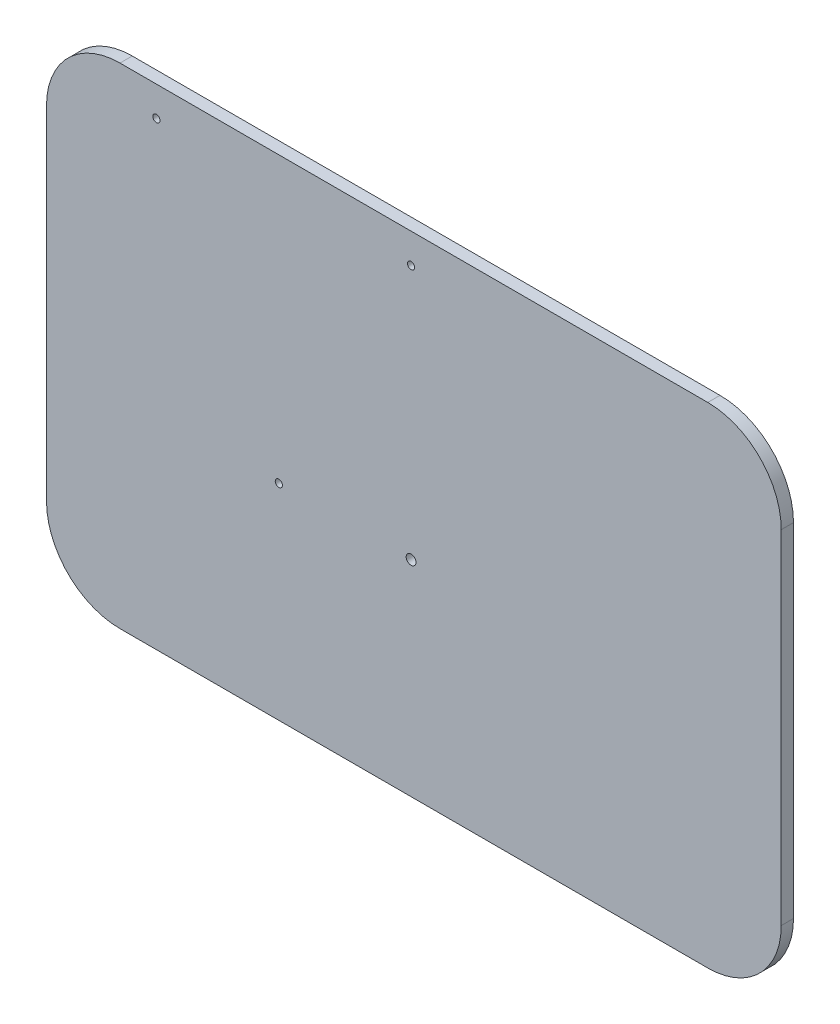
ISO-10303-21;
HEADER;
FILE_DESCRIPTION(('STEP AP214'),'2;1');
FILE_NAME('part.step','',(''),(''),'','','');
FILE_SCHEMA(('AUTOMOTIVE_DESIGN { 1 0 10303 214 1 1 1 1 }'));
ENDSEC;
DATA;
#1=APPLICATION_CONTEXT('core data for automotive mechanical design processes');
#2=APPLICATION_PROTOCOL_DEFINITION('international standard','automotive_design',2000,#1);
#3=PRODUCT_CONTEXT('',#1,'mechanical');
#4=PRODUCT('Part','Part','',(#3));
#5=PRODUCT_RELATED_PRODUCT_CATEGORY('part','',(#4));
#6=PRODUCT_DEFINITION_FORMATION('','',#4);
#7=PRODUCT_DEFINITION_CONTEXT('part definition',#1,'design');
#8=PRODUCT_DEFINITION('design','',#6,#7);
#9=PRODUCT_DEFINITION_SHAPE('','',#8);
#10=(LENGTH_UNIT() NAMED_UNIT(*) SI_UNIT(.MILLI.,.METRE.));
#11=(NAMED_UNIT(*) PLANE_ANGLE_UNIT() SI_UNIT($,.RADIAN.));
#12=(NAMED_UNIT(*) SI_UNIT($,.STERADIAN.) SOLID_ANGLE_UNIT());
#13=UNCERTAINTY_MEASURE_WITH_UNIT(LENGTH_MEASURE(1.E-05),#10,'distance_accuracy_value','');
#14=(GEOMETRIC_REPRESENTATION_CONTEXT(3) GLOBAL_UNCERTAINTY_ASSIGNED_CONTEXT((#13)) GLOBAL_UNIT_ASSIGNED_CONTEXT((#10,
#11,#12)) REPRESENTATION_CONTEXT('',''));
#15=CARTESIAN_POINT('',(0.,0.,0.));
#16=DIRECTION('',(0.,0.,1.));
#17=DIRECTION('',(1.,0.,0.));
#18=AXIS2_PLACEMENT_3D('',#15,#16,#17);
#19=CARTESIAN_POINT('',(30.,30.,5.));
#20=DIRECTION('',(0.,0.,-1.));
#21=DIRECTION('',(-1.,0.,0.));
#22=AXIS2_PLACEMENT_3D('',#19,#20,#21);
#23=CYLINDRICAL_SURFACE('',#22,30.);
#24=CARTESIAN_POINT('',(30.,30.,0.));
#25=DIRECTION('',(0.,0.,1.));
#26=DIRECTION('',(-1.,0.,0.));
#27=AXIS2_PLACEMENT_3D('',#24,#25,#26);
#28=CIRCLE('',#27,30.);
#29=CARTESIAN_POINT('',(0.,30.0000000000002,0.));
#30=VERTEX_POINT('',#29);
#31=CARTESIAN_POINT('',(30.0000000000002,0.,0.));
#32=VERTEX_POINT('',#31);
#33=EDGE_CURVE('E130',#30,#32,#28,.T.);
#34=ORIENTED_EDGE('',*,*,#33,.T.);
#35=DIRECTION('',(0.,0.,-1.));
#36=VECTOR('',#35,1.);
#37=CARTESIAN_POINT('',(30.0000000000002,0.,5.));
#38=LINE('',#37,#36);
#39=CARTESIAN_POINT('',(30.0000000000002,0.,5.));
#40=VERTEX_POINT('',#39);
#41=EDGE_CURVE('E11',#40,#32,#38,.T.);
#42=ORIENTED_EDGE('',*,*,#41,.F.);
#43=CARTESIAN_POINT('',(30.,30.,5.));
#44=DIRECTION('',(0.,0.,1.));
#45=DIRECTION('',(-1.,0.,0.));
#46=AXIS2_PLACEMENT_3D('',#43,#44,#45);
#47=CIRCLE('',#46,30.);
#48=CARTESIAN_POINT('',(0.,30.0000000000002,5.));
#49=VERTEX_POINT('',#48);
#50=EDGE_CURVE('E145',#49,#40,#47,.T.);
#51=ORIENTED_EDGE('',*,*,#50,.F.);
#52=DIRECTION('',(0.,0.,-1.));
#53=VECTOR('',#52,1.);
#54=CARTESIAN_POINT('',(0.,30.0000000000002,5.));
#55=LINE('',#54,#53);
#56=EDGE_CURVE('E126',#49,#30,#55,.T.);
#57=ORIENTED_EDGE('',*,*,#56,.T.);
#58=EDGE_LOOP('',(#34,#42,#51,#57));
#59=FACE_BOUND('',#58,.T.);
#60=ADVANCED_FACE('F34',(#59),#23,.T.);
#61=CARTESIAN_POINT('',(30.0000000000002,0.,5.));
#62=DIRECTION('',(0.,1.,0.));
#63=DIRECTION('',(0.,0.,1.));
#64=AXIS2_PLACEMENT_3D('',#61,#62,#63);
#65=PLANE('',#64);
#66=DIRECTION('',(1.,0.,0.));
#67=VECTOR('',#66,1.);
#68=CARTESIAN_POINT('',(30.0000000000002,0.,0.));
#69=LINE('',#68,#67);
#70=CARTESIAN_POINT('',(270.,0.,0.));
#71=VERTEX_POINT('',#70);
#72=EDGE_CURVE('E133',#32,#71,#69,.T.);
#73=ORIENTED_EDGE('',*,*,#72,.T.);
#74=DIRECTION('',(0.,0.,-1.));
#75=VECTOR('',#74,1.);
#76=CARTESIAN_POINT('',(270.,0.,5.));
#77=LINE('',#76,#75);
#78=CARTESIAN_POINT('',(270.,0.,5.));
#79=VERTEX_POINT('',#78);
#80=EDGE_CURVE('E42',#79,#71,#77,.T.);
#81=ORIENTED_EDGE('',*,*,#80,.F.);
#82=DIRECTION('',(1.,0.,0.));
#83=VECTOR('',#82,1.);
#84=CARTESIAN_POINT('',(30.0000000000002,0.,5.));
#85=LINE('',#84,#83);
#86=EDGE_CURVE('E93',#40,#79,#85,.T.);
#87=ORIENTED_EDGE('',*,*,#86,.F.);
#88=ORIENTED_EDGE('',*,*,#41,.T.);
#89=EDGE_LOOP('',(#73,#81,#87,#88));
#90=FACE_BOUND('',#89,.T.);
#91=ADVANCED_FACE('F234',(#90),#65,.F.);
#92=CARTESIAN_POINT('',(270.,30.,5.));
#93=DIRECTION('',(0.,0.,-1.));
#94=DIRECTION('',(-1.,0.,0.));
#95=AXIS2_PLACEMENT_3D('',#92,#93,#94);
#96=CYLINDRICAL_SURFACE('',#95,30.);
#97=CARTESIAN_POINT('',(270.,30.,0.));
#98=DIRECTION('',(0.,0.,1.));
#99=DIRECTION('',(1.,0.,0.));
#100=AXIS2_PLACEMENT_3D('',#97,#98,#99);
#101=CIRCLE('',#100,30.);
#102=CARTESIAN_POINT('',(300.,30.,0.));
#103=VERTEX_POINT('',#102);
#104=EDGE_CURVE('E136',#71,#103,#101,.T.);
#105=ORIENTED_EDGE('',*,*,#104,.T.);
#106=DIRECTION('',(0.,0.,-1.));
#107=VECTOR('',#106,1.);
#108=CARTESIAN_POINT('',(300.,30.,5.));
#109=LINE('',#108,#107);
#110=CARTESIAN_POINT('',(300.,30.,5.));
#111=VERTEX_POINT('',#110);
#112=EDGE_CURVE('E152',#111,#103,#109,.T.);
#113=ORIENTED_EDGE('',*,*,#112,.F.);
#114=CARTESIAN_POINT('',(270.,30.,5.));
#115=DIRECTION('',(0.,0.,1.));
#116=DIRECTION('',(1.,0.,0.));
#117=AXIS2_PLACEMENT_3D('',#114,#115,#116);
#118=CIRCLE('',#117,30.);
#119=EDGE_CURVE('E160',#79,#111,#118,.T.);
#120=ORIENTED_EDGE('',*,*,#119,.F.);
#121=ORIENTED_EDGE('',*,*,#80,.T.);
#122=EDGE_LOOP('',(#105,#113,#120,#121));
#123=FACE_BOUND('',#122,.T.);
#124=ADVANCED_FACE('F158',(#123),#96,.T.);
#125=CARTESIAN_POINT('',(300.,30.0000000000002,5.));
#126=DIRECTION('',(-1.,0.,0.));
#127=DIRECTION('',(0.,0.,1.));
#128=AXIS2_PLACEMENT_3D('',#125,#126,#127);
#129=PLANE('',#128);
#130=DIRECTION('',(0.,1.,0.));
#131=VECTOR('',#130,1.);
#132=CARTESIAN_POINT('',(300.,30.0000000000002,0.));
#133=LINE('',#132,#131);
#134=CARTESIAN_POINT('',(300.,170.,0.));
#135=VERTEX_POINT('',#134);
#136=EDGE_CURVE('E138',#103,#135,#133,.T.);
#137=ORIENTED_EDGE('',*,*,#136,.T.);
#138=DIRECTION('',(0.,0.,-1.));
#139=VECTOR('',#138,1.);
#140=CARTESIAN_POINT('',(300.,170.,5.));
#141=LINE('',#140,#139);
#142=CARTESIAN_POINT('',(300.,170.,5.));
#143=VERTEX_POINT('',#142);
#144=EDGE_CURVE('E149',#143,#135,#141,.T.);
#145=ORIENTED_EDGE('',*,*,#144,.F.);
#146=DIRECTION('',(0.,1.,0.));
#147=VECTOR('',#146,1.);
#148=CARTESIAN_POINT('',(300.,30.0000000000002,5.));
#149=LINE('',#148,#147);
#150=EDGE_CURVE('E172',#111,#143,#149,.T.);
#151=ORIENTED_EDGE('',*,*,#150,.F.);
#152=ORIENTED_EDGE('',*,*,#112,.T.);
#153=EDGE_LOOP('',(#137,#145,#151,#152));
#154=FACE_BOUND('',#153,.T.);
#155=ADVANCED_FACE('F168',(#154),#129,.F.);
#156=CARTESIAN_POINT('',(270.,170.,5.));
#157=DIRECTION('',(0.,0.,-1.));
#158=DIRECTION('',(-1.,0.,0.));
#159=AXIS2_PLACEMENT_3D('',#156,#157,#158);
#160=CYLINDRICAL_SURFACE('',#159,30.);
#161=CARTESIAN_POINT('',(270.,170.,0.));
#162=DIRECTION('',(0.,0.,1.));
#163=DIRECTION('',(-1.,0.,0.));
#164=AXIS2_PLACEMENT_3D('',#161,#162,#163);
#165=CIRCLE('',#164,30.);
#166=CARTESIAN_POINT('',(270.,200.,0.));
#167=VERTEX_POINT('',#166);
#168=EDGE_CURVE('E140',#135,#167,#165,.T.);
#169=ORIENTED_EDGE('',*,*,#168,.T.);
#170=DIRECTION('',(0.,0.,-1.));
#171=VECTOR('',#170,1.);
#172=CARTESIAN_POINT('',(270.,200.,5.));
#173=LINE('',#172,#171);
#174=CARTESIAN_POINT('',(270.,200.,5.));
#175=VERTEX_POINT('',#174);
#176=EDGE_CURVE('E121',#175,#167,#173,.T.);
#177=ORIENTED_EDGE('',*,*,#176,.F.);
#178=CARTESIAN_POINT('',(270.,170.,5.));
#179=DIRECTION('',(0.,0.,1.));
#180=DIRECTION('',(-1.,0.,0.));
#181=AXIS2_PLACEMENT_3D('',#178,#179,#180);
#182=CIRCLE('',#181,30.);
#183=EDGE_CURVE('E112',#143,#175,#182,.T.);
#184=ORIENTED_EDGE('',*,*,#183,.F.);
#185=ORIENTED_EDGE('',*,*,#144,.T.);
#186=EDGE_LOOP('',(#169,#177,#184,#185));
#187=FACE_BOUND('',#186,.T.);
#188=ADVANCED_FACE('F171',(#187),#160,.T.);
#189=CARTESIAN_POINT('',(30.,200.,5.));
#190=DIRECTION('',(0.,-1.,0.));
#191=DIRECTION('',(1.,0.,0.));
#192=AXIS2_PLACEMENT_3D('',#189,#190,#191);
#193=PLANE('',#192);
#194=DIRECTION('',(-1.,0.,0.));
#195=VECTOR('',#194,1.);
#196=CARTESIAN_POINT('',(30.,200.,0.));
#197=LINE('',#196,#195);
#198=CARTESIAN_POINT('',(30.,200.,0.));
#199=VERTEX_POINT('',#198);
#200=EDGE_CURVE('E120',#167,#199,#197,.T.);
#201=ORIENTED_EDGE('',*,*,#200,.T.);
#202=DIRECTION('',(0.,0.,-1.));
#203=VECTOR('',#202,1.);
#204=CARTESIAN_POINT('',(30.,200.,5.));
#205=LINE('',#204,#203);
#206=CARTESIAN_POINT('',(30.,200.,5.));
#207=VERTEX_POINT('',#206);
#208=EDGE_CURVE('E117',#207,#199,#205,.T.);
#209=ORIENTED_EDGE('',*,*,#208,.F.);
#210=DIRECTION('',(-1.,0.,0.));
#211=VECTOR('',#210,1.);
#212=CARTESIAN_POINT('',(30.,200.,5.));
#213=LINE('',#212,#211);
#214=EDGE_CURVE('E106',#175,#207,#213,.T.);
#215=ORIENTED_EDGE('',*,*,#214,.F.);
#216=ORIENTED_EDGE('',*,*,#176,.T.);
#217=EDGE_LOOP('',(#201,#209,#215,#216));
#218=FACE_BOUND('',#217,.T.);
#219=ADVANCED_FACE('F118',(#218),#193,.F.);
#220=CARTESIAN_POINT('',(30.,170.,5.));
#221=DIRECTION('',(0.,0.,-1.));
#222=DIRECTION('',(-1.,0.,0.));
#223=AXIS2_PLACEMENT_3D('',#220,#221,#222);
#224=CYLINDRICAL_SURFACE('',#223,30.);
#225=CARTESIAN_POINT('',(30.,170.,0.));
#226=DIRECTION('',(0.,0.,1.));
#227=DIRECTION('',(-1.,0.,0.));
#228=AXIS2_PLACEMENT_3D('',#225,#226,#227);
#229=CIRCLE('',#228,30.);
#230=CARTESIAN_POINT('',(0.,170.,0.));
#231=VERTEX_POINT('',#230);
#232=EDGE_CURVE('E79',#199,#231,#229,.T.);
#233=ORIENTED_EDGE('',*,*,#232,.T.);
#234=DIRECTION('',(0.,0.,-1.));
#235=VECTOR('',#234,1.);
#236=CARTESIAN_POINT('',(0.,170.,5.));
#237=LINE('',#236,#235);
#238=CARTESIAN_POINT('',(0.,170.,5.));
#239=VERTEX_POINT('',#238);
#240=EDGE_CURVE('E122',#239,#231,#237,.T.);
#241=ORIENTED_EDGE('',*,*,#240,.F.);
#242=CARTESIAN_POINT('',(30.,170.,5.));
#243=DIRECTION('',(0.,0.,1.));
#244=DIRECTION('',(-1.,0.,0.));
#245=AXIS2_PLACEMENT_3D('',#242,#243,#244);
#246=CIRCLE('',#245,30.);
#247=EDGE_CURVE('E110',#207,#239,#246,.T.);
#248=ORIENTED_EDGE('',*,*,#247,.F.);
#249=ORIENTED_EDGE('',*,*,#208,.T.);
#250=EDGE_LOOP('',(#233,#241,#248,#249));
#251=FACE_BOUND('',#250,.T.);
#252=ADVANCED_FACE('F124',(#251),#224,.T.);
#253=CARTESIAN_POINT('',(0.,30.0000000000002,5.));
#254=DIRECTION('',(1.,0.,0.));
#255=DIRECTION('',(0.,0.,-1.));
#256=AXIS2_PLACEMENT_3D('',#253,#254,#255);
#257=PLANE('',#256);
#258=DIRECTION('',(0.,-1.,0.));
#259=VECTOR('',#258,1.);
#260=CARTESIAN_POINT('',(0.,30.0000000000002,0.));
#261=LINE('',#260,#259);
#262=EDGE_CURVE('E85',#231,#30,#261,.T.);
#263=ORIENTED_EDGE('',*,*,#262,.T.);
#264=ORIENTED_EDGE('',*,*,#56,.F.);
#265=DIRECTION('',(0.,-1.,0.));
#266=VECTOR('',#265,1.);
#267=CARTESIAN_POINT('',(0.,30.0000000000002,5.));
#268=LINE('',#267,#266);
#269=EDGE_CURVE('E50',#239,#49,#268,.T.);
#270=ORIENTED_EDGE('',*,*,#269,.F.);
#271=ORIENTED_EDGE('',*,*,#240,.T.);
#272=EDGE_LOOP('',(#263,#264,#270,#271));
#273=FACE_BOUND('',#272,.T.);
#274=ADVANCED_FACE('F241',(#273),#257,.F.);
#275=CARTESIAN_POINT('',(30.,30.,5.));
#276=DIRECTION('',(0.,0.,-1.));
#277=DIRECTION('',(-1.,0.,0.));
#278=AXIS2_PLACEMENT_3D('',#275,#276,#277);
#279=PLANE('',#278);
#280=CARTESIAN_POINT('',(44.8516995792706,187.841418574777,5.));
#281=DIRECTION('',(0.,0.,-1.));
#282=DIRECTION('',(-1.,0.,0.));
#283=AXIS2_PLACEMENT_3D('',#280,#281,#282);
#284=CIRCLE('',#283,1.46545912533402);
#285=CARTESIAN_POINT('',(43.3862404539366,187.841418574777,5.));
#286=VERTEX_POINT('',#285);
#287=EDGE_CURVE('E181',#286,#286,#284,.T.);
#288=ORIENTED_EDGE('',*,*,#287,.T.);
#289=EDGE_LOOP('',(#288));
#290=FACE_BOUND('',#289,.T.);
#291=CARTESIAN_POINT('',(94.8516995792706,83.8414185747771,5.));
#292=DIRECTION('',(0.,0.,-1.));
#293=DIRECTION('',(-1.,0.,0.));
#294=AXIS2_PLACEMENT_3D('',#291,#292,#293);
#295=CIRCLE('',#294,1.46545912533402);
#296=CARTESIAN_POINT('',(93.3862404539366,83.8414185747771,5.));
#297=VERTEX_POINT('',#296);
#298=EDGE_CURVE('E193',#297,#297,#295,.T.);
#299=ORIENTED_EDGE('',*,*,#298,.T.);
#300=EDGE_LOOP('',(#299));
#301=FACE_BOUND('',#300,.T.);
#302=CARTESIAN_POINT('',(148.851699579271,83.8414185747771,5.));
#303=DIRECTION('',(0.,0.,-1.));
#304=DIRECTION('',(-1.,0.,0.));
#305=AXIS2_PLACEMENT_3D('',#302,#303,#304);
#306=CIRCLE('',#305,2.);
#307=CARTESIAN_POINT('',(146.851699579271,83.8414185747771,5.));
#308=VERTEX_POINT('',#307);
#309=EDGE_CURVE('E187',#308,#308,#306,.T.);
#310=ORIENTED_EDGE('',*,*,#309,.T.);
#311=EDGE_LOOP('',(#310));
#312=FACE_BOUND('',#311,.T.);
#313=CARTESIAN_POINT('',(148.851699579271,187.841418574777,5.));
#314=DIRECTION('',(0.,0.,-1.));
#315=DIRECTION('',(-1.,0.,0.));
#316=AXIS2_PLACEMENT_3D('',#313,#314,#315);
#317=CIRCLE('',#316,1.46545912533402);
#318=CARTESIAN_POINT('',(147.386240453937,187.841418574777,5.));
#319=VERTEX_POINT('',#318);
#320=EDGE_CURVE('E134',#319,#319,#317,.T.);
#321=ORIENTED_EDGE('',*,*,#320,.T.);
#322=EDGE_LOOP('',(#321));
#323=FACE_BOUND('',#322,.T.);
#324=ORIENTED_EDGE('',*,*,#50,.T.);
#325=ORIENTED_EDGE('',*,*,#86,.T.);
#326=ORIENTED_EDGE('',*,*,#119,.T.);
#327=ORIENTED_EDGE('',*,*,#150,.T.);
#328=ORIENTED_EDGE('',*,*,#183,.T.);
#329=ORIENTED_EDGE('',*,*,#214,.T.);
#330=ORIENTED_EDGE('',*,*,#247,.T.);
#331=ORIENTED_EDGE('',*,*,#269,.T.);
#332=EDGE_LOOP('',(#324,#325,#326,#327,#328,#329,#330,#331));
#333=FACE_BOUND('',#332,.T.);
#334=ADVANCED_FACE('F108',(#290,#301,#312,#323,#333),#279,.F.);
#335=CARTESIAN_POINT('',(30.,30.,0.));
#336=DIRECTION('',(0.,0.,-1.));
#337=DIRECTION('',(-1.,0.,0.));
#338=AXIS2_PLACEMENT_3D('',#335,#336,#337);
#339=PLANE('',#338);
#340=CARTESIAN_POINT('',(44.8516995792706,187.841418574777,0.));
#341=DIRECTION('',(0.,0.,-1.));
#342=DIRECTION('',(-1.,0.,0.));
#343=AXIS2_PLACEMENT_3D('',#340,#341,#342);
#344=CIRCLE('',#343,1.46545912533402);
#345=CARTESIAN_POINT('',(43.3862404539366,187.841418574777,0.));
#346=VERTEX_POINT('',#345);
#347=EDGE_CURVE('E196',#346,#346,#344,.T.);
#348=ORIENTED_EDGE('',*,*,#347,.F.);
#349=EDGE_LOOP('',(#348));
#350=FACE_BOUND('',#349,.T.);
#351=CARTESIAN_POINT('',(94.8516995792706,83.8414185747771,0.));
#352=DIRECTION('',(0.,0.,-1.));
#353=DIRECTION('',(-1.,0.,0.));
#354=AXIS2_PLACEMENT_3D('',#351,#352,#353);
#355=CIRCLE('',#354,1.46545912533402);
#356=CARTESIAN_POINT('',(93.3862404539366,83.8414185747771,0.));
#357=VERTEX_POINT('',#356);
#358=EDGE_CURVE('E190',#357,#357,#355,.T.);
#359=ORIENTED_EDGE('',*,*,#358,.F.);
#360=EDGE_LOOP('',(#359));
#361=FACE_BOUND('',#360,.T.);
#362=CARTESIAN_POINT('',(148.851699579271,83.8414185747771,0.));
#363=DIRECTION('',(0.,0.,-1.));
#364=DIRECTION('',(-1.,0.,0.));
#365=AXIS2_PLACEMENT_3D('',#362,#363,#364);
#366=CIRCLE('',#365,2.);
#367=CARTESIAN_POINT('',(146.851699579271,83.8414185747771,0.));
#368=VERTEX_POINT('',#367);
#369=EDGE_CURVE('E184',#368,#368,#366,.T.);
#370=ORIENTED_EDGE('',*,*,#369,.F.);
#371=EDGE_LOOP('',(#370));
#372=FACE_BOUND('',#371,.T.);
#373=CARTESIAN_POINT('',(148.851699579271,187.841418574777,0.));
#374=DIRECTION('',(0.,0.,-1.));
#375=DIRECTION('',(-1.,0.,0.));
#376=AXIS2_PLACEMENT_3D('',#373,#374,#375);
#377=CIRCLE('',#376,1.46545912533402);
#378=CARTESIAN_POINT('',(147.386240453937,187.841418574777,0.));
#379=VERTEX_POINT('',#378);
#380=EDGE_CURVE('E178',#379,#379,#377,.T.);
#381=ORIENTED_EDGE('',*,*,#380,.F.);
#382=EDGE_LOOP('',(#381));
#383=FACE_BOUND('',#382,.T.);
#384=ORIENTED_EDGE('',*,*,#33,.F.);
#385=ORIENTED_EDGE('',*,*,#262,.F.);
#386=ORIENTED_EDGE('',*,*,#232,.F.);
#387=ORIENTED_EDGE('',*,*,#200,.F.);
#388=ORIENTED_EDGE('',*,*,#168,.F.);
#389=ORIENTED_EDGE('',*,*,#136,.F.);
#390=ORIENTED_EDGE('',*,*,#104,.F.);
#391=ORIENTED_EDGE('',*,*,#72,.F.);
#392=EDGE_LOOP('',(#384,#385,#386,#387,#388,#389,#390,#391));
#393=FACE_BOUND('',#392,.T.);
#394=ADVANCED_FACE('F164',(#350,#361,#372,#383,#393),#339,.T.);
#395=CARTESIAN_POINT('',(148.851699579271,187.841418574777,5.));
#396=DIRECTION('',(0.,0.,-1.));
#397=DIRECTION('',(-1.,0.,0.));
#398=AXIS2_PLACEMENT_3D('',#395,#396,#397);
#399=CYLINDRICAL_SURFACE('',#398,1.46545912533402);
#400=ORIENTED_EDGE('',*,*,#320,.F.);
#401=EDGE_LOOP('',(#400));
#402=FACE_BOUND('',#401,.T.);
#403=ORIENTED_EDGE('',*,*,#380,.T.);
#404=EDGE_LOOP('',(#403));
#405=FACE_BOUND('',#404,.T.);
#406=ADVANCED_FACE('F213',(#402,#405),#399,.F.);
#407=CARTESIAN_POINT('',(148.851699579271,83.8414185747771,5.));
#408=DIRECTION('',(0.,0.,-1.));
#409=DIRECTION('',(-1.,0.,0.));
#410=AXIS2_PLACEMENT_3D('',#407,#408,#409);
#411=CYLINDRICAL_SURFACE('',#410,2.);
#412=ORIENTED_EDGE('',*,*,#309,.F.);
#413=EDGE_LOOP('',(#412));
#414=FACE_BOUND('',#413,.T.);
#415=ORIENTED_EDGE('',*,*,#369,.T.);
#416=EDGE_LOOP('',(#415));
#417=FACE_BOUND('',#416,.T.);
#418=ADVANCED_FACE('F222',(#414,#417),#411,.F.);
#419=CARTESIAN_POINT('',(94.8516995792706,83.8414185747771,5.));
#420=DIRECTION('',(0.,0.,-1.));
#421=DIRECTION('',(-1.,0.,0.));
#422=AXIS2_PLACEMENT_3D('',#419,#420,#421);
#423=CYLINDRICAL_SURFACE('',#422,1.46545912533402);
#424=ORIENTED_EDGE('',*,*,#298,.F.);
#425=EDGE_LOOP('',(#424));
#426=FACE_BOUND('',#425,.T.);
#427=ORIENTED_EDGE('',*,*,#358,.T.);
#428=EDGE_LOOP('',(#427));
#429=FACE_BOUND('',#428,.T.);
#430=ADVANCED_FACE('F207',(#426,#429),#423,.F.);
#431=CARTESIAN_POINT('',(44.8516995792706,187.841418574777,5.));
#432=DIRECTION('',(0.,0.,-1.));
#433=DIRECTION('',(-1.,0.,0.));
#434=AXIS2_PLACEMENT_3D('',#431,#432,#433);
#435=CYLINDRICAL_SURFACE('',#434,1.46545912533402);
#436=ORIENTED_EDGE('',*,*,#287,.F.);
#437=EDGE_LOOP('',(#436));
#438=FACE_BOUND('',#437,.T.);
#439=ORIENTED_EDGE('',*,*,#347,.T.);
#440=EDGE_LOOP('',(#439));
#441=FACE_BOUND('',#440,.T.);
#442=ADVANCED_FACE('F204',(#438,#441),#435,.F.);
#443=CLOSED_SHELL('',(#60,#91,#124,#155,#188,#219,#252,#274,#334,#394,#406,#418,#430,#442));
#444=MANIFOLD_SOLID_BREP('B2',#443);
#445=ADVANCED_BREP_SHAPE_REPRESENTATION('',(#18,#444),#14);
#446=SHAPE_DEFINITION_REPRESENTATION(#9,#445);
ENDSEC;
END-ISO-10303-21;
